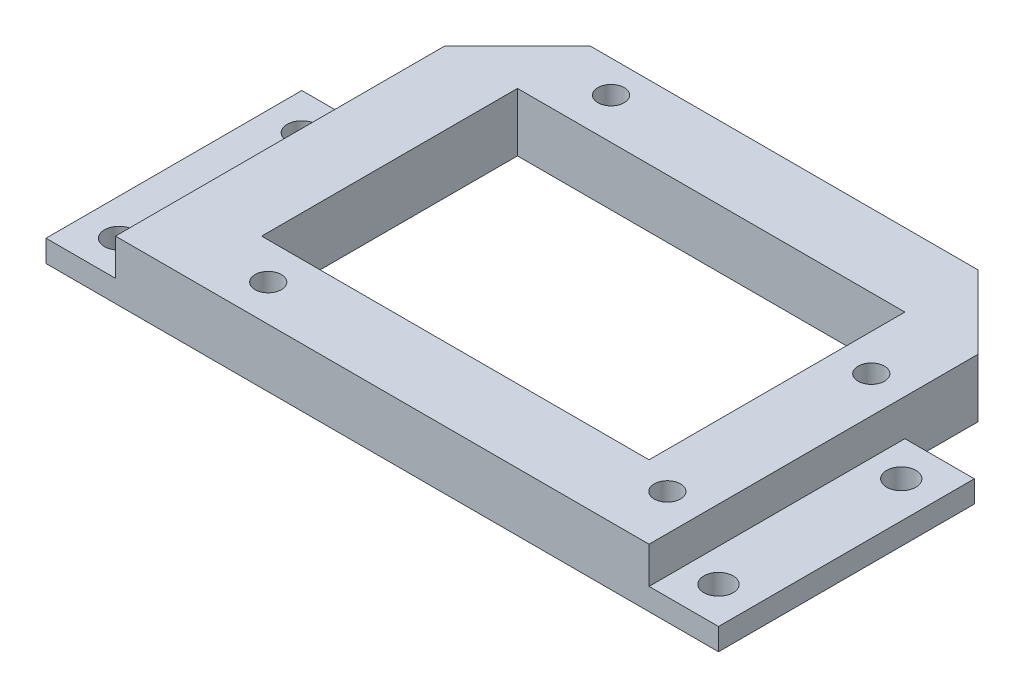
ISO-10303-21;
HEADER;
FILE_DESCRIPTION(('STEP AP214'),'2;1');
FILE_NAME('part.step','',(''),(''),'','','');
FILE_SCHEMA(('AUTOMOTIVE_DESIGN { 1 0 10303 214 1 1 1 1 }'));
ENDSEC;
DATA;
#1=APPLICATION_CONTEXT('core data for automotive mechanical design processes');
#2=APPLICATION_PROTOCOL_DEFINITION('international standard','automotive_design',2000,#1);
#3=PRODUCT_CONTEXT('',#1,'mechanical');
#4=PRODUCT('Part','Part','',(#3));
#5=PRODUCT_RELATED_PRODUCT_CATEGORY('part','',(#4));
#6=PRODUCT_DEFINITION_FORMATION('','',#4);
#7=PRODUCT_DEFINITION_CONTEXT('part definition',#1,'design');
#8=PRODUCT_DEFINITION('design','',#6,#7);
#9=PRODUCT_DEFINITION_SHAPE('','',#8);
#10=(LENGTH_UNIT() NAMED_UNIT(*) SI_UNIT(.MILLI.,.METRE.));
#11=(NAMED_UNIT(*) PLANE_ANGLE_UNIT() SI_UNIT($,.RADIAN.));
#12=(NAMED_UNIT(*) SI_UNIT($,.STERADIAN.) SOLID_ANGLE_UNIT());
#13=UNCERTAINTY_MEASURE_WITH_UNIT(LENGTH_MEASURE(1.E-05),#10,'distance_accuracy_value','');
#14=(GEOMETRIC_REPRESENTATION_CONTEXT(3) GLOBAL_UNCERTAINTY_ASSIGNED_CONTEXT((#13)) GLOBAL_UNIT_ASSIGNED_CONTEXT((#10,
#11,#12)) REPRESENTATION_CONTEXT('',''));
#15=CARTESIAN_POINT('',(0.,0.,0.));
#16=DIRECTION('',(0.,0.,1.));
#17=DIRECTION('',(1.,0.,0.));
#18=AXIS2_PLACEMENT_3D('',#15,#16,#17);
#19=CARTESIAN_POINT('',(-36.5,5.,-17.5));
#20=DIRECTION('',(0.,0.,1.));
#21=DIRECTION('',(1.,0.,0.));
#22=AXIS2_PLACEMENT_3D('',#19,#20,#21);
#23=PLANE('',#22);
#24=DIRECTION('',(0.,-1.,0.));
#25=VECTOR('',#24,1.);
#26=CARTESIAN_POINT('',(36.5,5.,-17.5));
#27=LINE('',#26,#25);
#28=CARTESIAN_POINT('',(36.5,0.,-17.5));
#29=VERTEX_POINT('',#28);
#30=CARTESIAN_POINT('',(36.5,-3.,-17.5));
#31=VERTEX_POINT('',#30);
#32=EDGE_CURVE('E241',#29,#31,#27,.T.);
#33=ORIENTED_EDGE('',*,*,#32,.F.);
#34=DIRECTION('',(1.,0.,0.));
#35=VECTOR('',#34,1.);
#36=CARTESIAN_POINT('',(-46.,0.,-17.5));
#37=LINE('',#36,#35);
#38=CARTESIAN_POINT('',(46.,0.,-17.5));
#39=VERTEX_POINT('',#38);
#40=EDGE_CURVE('E303',#29,#39,#37,.T.);
#41=ORIENTED_EDGE('',*,*,#40,.T.);
#42=DIRECTION('',(0.,1.,0.));
#43=VECTOR('',#42,1.);
#44=CARTESIAN_POINT('',(46.,-3.,-17.5));
#45=LINE('',#44,#43);
#46=CARTESIAN_POINT('',(46.,-3.,-17.5));
#47=VERTEX_POINT('',#46);
#48=EDGE_CURVE('E290',#47,#39,#45,.T.);
#49=ORIENTED_EDGE('',*,*,#48,.F.);
#50=DIRECTION('',(1.,0.,0.));
#51=VECTOR('',#50,1.);
#52=CARTESIAN_POINT('',(-46.,-3.,-17.5));
#53=LINE('',#52,#51);
#54=EDGE_CURVE('E285',#31,#47,#53,.T.);
#55=ORIENTED_EDGE('',*,*,#54,.F.);
#56=EDGE_LOOP('',(#33,#41,#49,#55));
#57=FACE_BOUND('',#56,.T.);
#58=ADVANCED_FACE('F41',(#57),#23,.F.);
#59=DIRECTION('',(0.,1.,0.));
#60=VECTOR('',#59,1.);
#61=CARTESIAN_POINT('',(-36.5,5.,-17.5));
#62=LINE('',#61,#60);
#63=CARTESIAN_POINT('',(-36.5,-3.,-17.5));
#64=VERTEX_POINT('',#63);
#65=CARTESIAN_POINT('',(-36.5,0.,-17.5));
#66=VERTEX_POINT('',#65);
#67=EDGE_CURVE('E236',#64,#66,#62,.T.);
#68=ORIENTED_EDGE('',*,*,#67,.F.);
#69=CARTESIAN_POINT('',(-46.,-3.,-17.5));
#70=VERTEX_POINT('',#69);
#71=EDGE_CURVE('E286',#70,#64,#53,.T.);
#72=ORIENTED_EDGE('',*,*,#71,.F.);
#73=DIRECTION('',(0.,1.,0.));
#74=VECTOR('',#73,1.);
#75=CARTESIAN_POINT('',(-46.,-3.,-17.5));
#76=LINE('',#75,#74);
#77=CARTESIAN_POINT('',(-46.,0.,-17.5));
#78=VERTEX_POINT('',#77);
#79=EDGE_CURVE('E310',#70,#78,#76,.T.);
#80=ORIENTED_EDGE('',*,*,#79,.T.);
#81=EDGE_CURVE('E279',#78,#66,#37,.T.);
#82=ORIENTED_EDGE('',*,*,#81,.T.);
#83=EDGE_LOOP('',(#68,#72,#80,#82));
#84=FACE_BOUND('',#83,.T.);
#85=ADVANCED_FACE('F431',(#84),#23,.F.);
#86=CARTESIAN_POINT('',(36.5,5.,17.5));
#87=DIRECTION('',(-1.,0.,0.));
#88=DIRECTION('',(0.,0.,1.));
#89=AXIS2_PLACEMENT_3D('',#86,#87,#88);
#90=PLANE('',#89);
#91=DIRECTION('',(0.,0.,1.));
#92=VECTOR('',#91,1.);
#93=CARTESIAN_POINT('',(36.5,-3.,-37.5));
#94=LINE('',#93,#92);
#95=CARTESIAN_POINT('',(36.5,-3.,-27.5));
#96=VERTEX_POINT('',#95);
#97=EDGE_CURVE('E251',#96,#31,#94,.T.);
#98=ORIENTED_EDGE('',*,*,#97,.F.);
#99=DIRECTION('',(0.,1.,0.));
#100=VECTOR('',#99,1.);
#101=CARTESIAN_POINT('',(36.5,5.,-27.5));
#102=LINE('',#101,#100);
#103=CARTESIAN_POINT('',(36.5,5.,-27.5));
#104=VERTEX_POINT('',#103);
#105=EDGE_CURVE('E11',#96,#104,#102,.T.);
#106=ORIENTED_EDGE('',*,*,#105,.T.);
#107=DIRECTION('',(0.,0.,-1.));
#108=VECTOR('',#107,1.);
#109=CARTESIAN_POINT('',(36.5,5.,17.5));
#110=LINE('',#109,#108);
#111=CARTESIAN_POINT('',(36.5,5.,17.5));
#112=VERTEX_POINT('',#111);
#113=EDGE_CURVE('E323',#112,#104,#110,.T.);
#114=ORIENTED_EDGE('',*,*,#113,.F.);
#115=DIRECTION('',(0.,-1.,0.));
#116=VECTOR('',#115,1.);
#117=CARTESIAN_POINT('',(36.5,5.,17.5));
#118=LINE('',#117,#116);
#119=CARTESIAN_POINT('',(36.5,0.,17.5));
#120=VERTEX_POINT('',#119);
#121=EDGE_CURVE('E334',#112,#120,#118,.T.);
#122=ORIENTED_EDGE('',*,*,#121,.T.);
#123=DIRECTION('',(0.,0.,-1.));
#124=VECTOR('',#123,1.);
#125=CARTESIAN_POINT('',(36.5,0.,17.5));
#126=LINE('',#125,#124);
#127=EDGE_CURVE('E322',#120,#29,#126,.T.);
#128=ORIENTED_EDGE('',*,*,#127,.T.);
#129=ORIENTED_EDGE('',*,*,#32,.T.);
#130=EDGE_LOOP('',(#98,#106,#114,#122,#128,#129));
#131=FACE_BOUND('',#130,.T.);
#132=ADVANCED_FACE('F410',(#131),#90,.F.);
#133=CARTESIAN_POINT('',(-36.5,5.,17.5));
#134=DIRECTION('',(1.,0.,0.));
#135=DIRECTION('',(0.,0.,-1.));
#136=AXIS2_PLACEMENT_3D('',#133,#134,#135);
#137=PLANE('',#136);
#138=DIRECTION('',(0.,0.,1.));
#139=VECTOR('',#138,1.);
#140=CARTESIAN_POINT('',(-36.5,5.,17.5));
#141=LINE('',#140,#139);
#142=CARTESIAN_POINT('',(-36.5,5.,-27.5));
#143=VERTEX_POINT('',#142);
#144=CARTESIAN_POINT('',(-36.5,5.,17.5));
#145=VERTEX_POINT('',#144);
#146=EDGE_CURVE('E327',#143,#145,#141,.T.);
#147=ORIENTED_EDGE('',*,*,#146,.F.);
#148=DIRECTION('',(0.,-1.,0.));
#149=VECTOR('',#148,1.);
#150=CARTESIAN_POINT('',(-36.5,-3.,-27.5));
#151=LINE('',#150,#149);
#152=CARTESIAN_POINT('',(-36.5,-3.,-27.5));
#153=VERTEX_POINT('',#152);
#154=EDGE_CURVE('E66',#143,#153,#151,.T.);
#155=ORIENTED_EDGE('',*,*,#154,.T.);
#156=DIRECTION('',(0.,0.,1.));
#157=VECTOR('',#156,1.);
#158=CARTESIAN_POINT('',(-36.5,-3.,-37.5));
#159=LINE('',#158,#157);
#160=EDGE_CURVE('E240',#153,#64,#159,.T.);
#161=ORIENTED_EDGE('',*,*,#160,.T.);
#162=ORIENTED_EDGE('',*,*,#67,.T.);
#163=DIRECTION('',(0.,0.,1.));
#164=VECTOR('',#163,1.);
#165=CARTESIAN_POINT('',(-36.5,0.,17.5));
#166=LINE('',#165,#164);
#167=CARTESIAN_POINT('',(-36.5,0.,17.5));
#168=VERTEX_POINT('',#167);
#169=EDGE_CURVE('E328',#66,#168,#166,.T.);
#170=ORIENTED_EDGE('',*,*,#169,.T.);
#171=DIRECTION('',(0.,-1.,0.));
#172=VECTOR('',#171,1.);
#173=CARTESIAN_POINT('',(-36.5,5.,17.5));
#174=LINE('',#173,#172);
#175=EDGE_CURVE('E246',#145,#168,#174,.T.);
#176=ORIENTED_EDGE('',*,*,#175,.F.);
#177=EDGE_LOOP('',(#147,#155,#161,#162,#170,#176));
#178=FACE_BOUND('',#177,.T.);
#179=ADVANCED_FACE('F399',(#178),#137,.F.);
#180=CARTESIAN_POINT('',(-36.5,5.,17.5));
#181=DIRECTION('',(0.,0.,-1.));
#182=DIRECTION('',(-1.,0.,0.));
#183=AXIS2_PLACEMENT_3D('',#180,#181,#182);
#184=PLANE('',#183);
#185=ORIENTED_EDGE('',*,*,#175,.T.);
#186=DIRECTION('',(-1.,0.,0.));
#187=VECTOR('',#186,1.);
#188=CARTESIAN_POINT('',(-46.,0.,17.5));
#189=LINE('',#188,#187);
#190=CARTESIAN_POINT('',(-46.,0.,17.5));
#191=VERTEX_POINT('',#190);
#192=EDGE_CURVE('E295',#168,#191,#189,.T.);
#193=ORIENTED_EDGE('',*,*,#192,.T.);
#194=DIRECTION('',(0.,1.,0.));
#195=VECTOR('',#194,1.);
#196=CARTESIAN_POINT('',(-46.,-3.,17.5));
#197=LINE('',#196,#195);
#198=CARTESIAN_POINT('',(-46.,-3.,17.5));
#199=VERTEX_POINT('',#198);
#200=EDGE_CURVE('E314',#199,#191,#197,.T.);
#201=ORIENTED_EDGE('',*,*,#200,.F.);
#202=DIRECTION('',(-1.,0.,0.));
#203=VECTOR('',#202,1.);
#204=CARTESIAN_POINT('',(-46.,-3.,17.5));
#205=LINE('',#204,#203);
#206=CARTESIAN_POINT('',(46.,-3.,17.5));
#207=VERTEX_POINT('',#206);
#208=EDGE_CURVE('E278',#207,#199,#205,.T.);
#209=ORIENTED_EDGE('',*,*,#208,.F.);
#210=DIRECTION('',(0.,1.,0.));
#211=VECTOR('',#210,1.);
#212=CARTESIAN_POINT('',(46.,-3.,17.5));
#213=LINE('',#212,#211);
#214=CARTESIAN_POINT('',(46.,0.,17.5));
#215=VERTEX_POINT('',#214);
#216=EDGE_CURVE('E318',#207,#215,#213,.T.);
#217=ORIENTED_EDGE('',*,*,#216,.T.);
#218=EDGE_CURVE('E296',#215,#120,#189,.T.);
#219=ORIENTED_EDGE('',*,*,#218,.T.);
#220=ORIENTED_EDGE('',*,*,#121,.F.);
#221=DIRECTION('',(1.,0.,0.));
#222=VECTOR('',#221,1.);
#223=CARTESIAN_POINT('',(-36.5,5.,17.5));
#224=LINE('',#223,#222);
#225=EDGE_CURVE('E331',#145,#112,#224,.T.);
#226=ORIENTED_EDGE('',*,*,#225,.F.);
#227=EDGE_LOOP('',(#185,#193,#201,#209,#217,#219,#220,#226));
#228=FACE_BOUND('',#227,.T.);
#229=ADVANCED_FACE('F404',(#228),#184,.F.);
#230=CARTESIAN_POINT('',(0.,5.,0.));
#231=DIRECTION('',(0.,-1.,0.));
#232=DIRECTION('',(0.,0.,-1.));
#233=AXIS2_PLACEMENT_3D('',#230,#231,#232);
#234=PLANE('',#233);
#235=DIRECTION('',(0.,0.,-1.));
#236=VECTOR('',#235,1.);
#237=CARTESIAN_POINT('',(26.5,5.,7.5));
#238=LINE('',#237,#236);
#239=CARTESIAN_POINT('',(26.5,5.,7.5));
#240=VERTEX_POINT('',#239);
#241=CARTESIAN_POINT('',(26.5,5.,-27.5));
#242=VERTEX_POINT('',#241);
#243=EDGE_CURVE('E197',#240,#242,#238,.T.);
#244=ORIENTED_EDGE('',*,*,#243,.F.);
#245=DIRECTION('',(1.,0.,0.));
#246=VECTOR('',#245,1.);
#247=CARTESIAN_POINT('',(-26.5,5.,7.5));
#248=LINE('',#247,#246);
#249=CARTESIAN_POINT('',(-26.5,5.,7.5));
#250=VERTEX_POINT('',#249);
#251=EDGE_CURVE('E163',#250,#240,#248,.T.);
#252=ORIENTED_EDGE('',*,*,#251,.F.);
#253=DIRECTION('',(0.,0.,1.));
#254=VECTOR('',#253,1.);
#255=CARTESIAN_POINT('',(-26.5,5.,-27.5));
#256=LINE('',#255,#254);
#257=CARTESIAN_POINT('',(-26.5,5.,-27.5));
#258=VERTEX_POINT('',#257);
#259=EDGE_CURVE('E184',#258,#250,#256,.T.);
#260=ORIENTED_EDGE('',*,*,#259,.F.);
#261=DIRECTION('',(-1.,0.,0.));
#262=VECTOR('',#261,1.);
#263=CARTESIAN_POINT('',(26.5,5.,-27.5));
#264=LINE('',#263,#262);
#265=EDGE_CURVE('E188',#242,#258,#264,.T.);
#266=ORIENTED_EDGE('',*,*,#265,.F.);
#267=EDGE_LOOP('',(#244,#252,#260,#266));
#268=FACE_BOUND('',#267,.T.);
#269=CARTESIAN_POINT('',(-20.6,5.,12.5));
#270=DIRECTION('',(0.,1.,0.));
#271=DIRECTION('',(0.,0.,1.));
#272=AXIS2_PLACEMENT_3D('',#269,#270,#271);
#273=CIRCLE('',#272,1.8);
#274=CARTESIAN_POINT('',(-20.6,5.,14.3));
#275=VERTEX_POINT('',#274);
#276=EDGE_CURVE('E206',#275,#275,#273,.T.);
#277=ORIENTED_EDGE('',*,*,#276,.F.);
#278=EDGE_LOOP('',(#277));
#279=FACE_BOUND('',#278,.T.);
#280=CARTESIAN_POINT('',(-19.3,5.,-33.1));
#281=DIRECTION('',(0.,1.,0.));
#282=DIRECTION('',(0.,0.,1.));
#283=AXIS2_PLACEMENT_3D('',#280,#281,#282);
#284=CIRCLE('',#283,1.8);
#285=CARTESIAN_POINT('',(-19.3,5.,-31.3));
#286=VERTEX_POINT('',#285);
#287=EDGE_CURVE('E216',#286,#286,#284,.T.);
#288=ORIENTED_EDGE('',*,*,#287,.F.);
#289=EDGE_LOOP('',(#288));
#290=FACE_BOUND('',#289,.T.);
#291=CARTESIAN_POINT('',(31.5,5.,10.));
#292=DIRECTION('',(0.,1.,0.));
#293=DIRECTION('',(0.,0.,1.));
#294=AXIS2_PLACEMENT_3D('',#291,#292,#293);
#295=CIRCLE('',#294,1.8);
#296=CARTESIAN_POINT('',(31.5,5.,11.8));
#297=VERTEX_POINT('',#296);
#298=EDGE_CURVE('E221',#297,#297,#295,.T.);
#299=ORIENTED_EDGE('',*,*,#298,.F.);
#300=EDGE_LOOP('',(#299));
#301=FACE_BOUND('',#300,.T.);
#302=CARTESIAN_POINT('',(31.5,5.,-17.9));
#303=DIRECTION('',(0.,1.,0.));
#304=DIRECTION('',(0.,0.,1.));
#305=AXIS2_PLACEMENT_3D('',#302,#303,#304);
#306=CIRCLE('',#305,1.8);
#307=CARTESIAN_POINT('',(31.5,5.,-16.1));
#308=VERTEX_POINT('',#307);
#309=EDGE_CURVE('E226',#308,#308,#306,.T.);
#310=ORIENTED_EDGE('',*,*,#309,.F.);
#311=EDGE_LOOP('',(#310));
#312=FACE_BOUND('',#311,.T.);
#313=DIRECTION('',(1.,0.,0.));
#314=VECTOR('',#313,1.);
#315=CARTESIAN_POINT('',(36.5,5.,-37.5));
#316=LINE('',#315,#314);
#317=CARTESIAN_POINT('',(-26.5,5.,-37.5));
#318=VERTEX_POINT('',#317);
#319=CARTESIAN_POINT('',(26.5,5.,-37.5));
#320=VERTEX_POINT('',#319);
#321=EDGE_CURVE('E235',#318,#320,#316,.T.);
#322=ORIENTED_EDGE('',*,*,#321,.F.);
#323=DIRECTION('',(-0.707106781186547,0.,0.707106781186548));
#324=VECTOR('',#323,1.);
#325=CARTESIAN_POINT('',(-26.5,5.,-37.5));
#326=LINE('',#325,#324);
#327=EDGE_CURVE('E381',#318,#143,#326,.T.);
#328=ORIENTED_EDGE('',*,*,#327,.T.);
#329=ORIENTED_EDGE('',*,*,#146,.T.);
#330=ORIENTED_EDGE('',*,*,#225,.T.);
#331=ORIENTED_EDGE('',*,*,#113,.T.);
#332=DIRECTION('',(-0.707106781186547,0.,-0.707106781186548));
#333=VECTOR('',#332,1.);
#334=CARTESIAN_POINT('',(26.5,5.,-37.5));
#335=LINE('',#334,#333);
#336=EDGE_CURVE('E378',#104,#320,#335,.T.);
#337=ORIENTED_EDGE('',*,*,#336,.T.);
#338=EDGE_LOOP('',(#322,#328,#329,#330,#331,#337));
#339=FACE_BOUND('',#338,.T.);
#340=ADVANCED_FACE('F397',(#268,#279,#290,#301,#312,#339),#234,.F.);
#341=CARTESIAN_POINT('',(0.,0.,0.));
#342=DIRECTION('',(0.,1.,0.));
#343=DIRECTION('',(0.,0.,1.));
#344=AXIS2_PLACEMENT_3D('',#341,#342,#343);
#345=PLANE('',#344);
#346=CARTESIAN_POINT('',(41.,0.,-12.5));
#347=DIRECTION('',(0.,1.,0.));
#348=DIRECTION('',(0.,0.,1.));
#349=AXIS2_PLACEMENT_3D('',#346,#347,#348);
#350=CIRCLE('',#349,2.);
#351=CARTESIAN_POINT('',(41.,0.,-10.5));
#352=VERTEX_POINT('',#351);
#353=EDGE_CURVE('E264',#352,#352,#350,.T.);
#354=ORIENTED_EDGE('',*,*,#353,.F.);
#355=EDGE_LOOP('',(#354));
#356=FACE_BOUND('',#355,.T.);
#357=CARTESIAN_POINT('',(41.,0.,12.5));
#358=DIRECTION('',(0.,1.,0.));
#359=DIRECTION('',(0.,0.,1.));
#360=AXIS2_PLACEMENT_3D('',#357,#358,#359);
#361=CIRCLE('',#360,2.);
#362=CARTESIAN_POINT('',(41.,0.,14.5));
#363=VERTEX_POINT('',#362);
#364=EDGE_CURVE('E269',#363,#363,#361,.T.);
#365=ORIENTED_EDGE('',*,*,#364,.F.);
#366=EDGE_LOOP('',(#365));
#367=FACE_BOUND('',#366,.T.);
#368=ORIENTED_EDGE('',*,*,#127,.F.);
#369=ORIENTED_EDGE('',*,*,#218,.F.);
#370=DIRECTION('',(0.,0.,1.));
#371=VECTOR('',#370,1.);
#372=CARTESIAN_POINT('',(46.,0.,-17.5));
#373=LINE('',#372,#371);
#374=EDGE_CURVE('E291',#39,#215,#373,.T.);
#375=ORIENTED_EDGE('',*,*,#374,.F.);
#376=ORIENTED_EDGE('',*,*,#40,.F.);
#377=EDGE_LOOP('',(#368,#369,#375,#376));
#378=FACE_BOUND('',#377,.T.);
#379=ADVANCED_FACE('F437',(#356,#367,#378),#345,.T.);
#380=CARTESIAN_POINT('',(-41.,0.,-12.5));
#381=DIRECTION('',(0.,1.,0.));
#382=DIRECTION('',(0.,0.,1.));
#383=AXIS2_PLACEMENT_3D('',#380,#381,#382);
#384=CIRCLE('',#383,2.);
#385=CARTESIAN_POINT('',(-41.,0.,-10.5));
#386=VERTEX_POINT('',#385);
#387=EDGE_CURVE('E254',#386,#386,#384,.T.);
#388=ORIENTED_EDGE('',*,*,#387,.F.);
#389=EDGE_LOOP('',(#388));
#390=FACE_BOUND('',#389,.T.);
#391=CARTESIAN_POINT('',(-41.,0.,12.5));
#392=DIRECTION('',(0.,1.,0.));
#393=DIRECTION('',(0.,0.,1.));
#394=AXIS2_PLACEMENT_3D('',#391,#392,#393);
#395=CIRCLE('',#394,2.);
#396=CARTESIAN_POINT('',(-41.,0.,14.5));
#397=VERTEX_POINT('',#396);
#398=EDGE_CURVE('E259',#397,#397,#395,.T.);
#399=ORIENTED_EDGE('',*,*,#398,.F.);
#400=EDGE_LOOP('',(#399));
#401=FACE_BOUND('',#400,.T.);
#402=ORIENTED_EDGE('',*,*,#169,.F.);
#403=ORIENTED_EDGE('',*,*,#81,.F.);
#404=DIRECTION('',(0.,0.,-1.));
#405=VECTOR('',#404,1.);
#406=CARTESIAN_POINT('',(-46.,0.,-17.5));
#407=LINE('',#406,#405);
#408=EDGE_CURVE('E300',#191,#78,#407,.T.);
#409=ORIENTED_EDGE('',*,*,#408,.F.);
#410=ORIENTED_EDGE('',*,*,#192,.F.);
#411=EDGE_LOOP('',(#402,#403,#409,#410));
#412=FACE_BOUND('',#411,.T.);
#413=ADVANCED_FACE('F433',(#390,#401,#412),#345,.T.);
#414=CARTESIAN_POINT('',(46.,-3.,-17.5));
#415=DIRECTION('',(-1.,0.,0.));
#416=DIRECTION('',(0.,0.,1.));
#417=AXIS2_PLACEMENT_3D('',#414,#415,#416);
#418=PLANE('',#417);
#419=ORIENTED_EDGE('',*,*,#374,.T.);
#420=ORIENTED_EDGE('',*,*,#216,.F.);
#421=DIRECTION('',(0.,0.,1.));
#422=VECTOR('',#421,1.);
#423=CARTESIAN_POINT('',(46.,-3.,-17.5));
#424=LINE('',#423,#422);
#425=EDGE_CURVE('E274',#47,#207,#424,.T.);
#426=ORIENTED_EDGE('',*,*,#425,.F.);
#427=ORIENTED_EDGE('',*,*,#48,.T.);
#428=EDGE_LOOP('',(#419,#420,#426,#427));
#429=FACE_BOUND('',#428,.T.);
#430=ADVANCED_FACE('F420',(#429),#418,.F.);
#431=CARTESIAN_POINT('',(-46.,-3.,-17.5));
#432=DIRECTION('',(1.,0.,0.));
#433=DIRECTION('',(0.,0.,-1.));
#434=AXIS2_PLACEMENT_3D('',#431,#432,#433);
#435=PLANE('',#434);
#436=ORIENTED_EDGE('',*,*,#408,.T.);
#437=ORIENTED_EDGE('',*,*,#79,.F.);
#438=DIRECTION('',(0.,0.,-1.));
#439=VECTOR('',#438,1.);
#440=CARTESIAN_POINT('',(-46.,-3.,-17.5));
#441=LINE('',#440,#439);
#442=EDGE_CURVE('E282',#199,#70,#441,.T.);
#443=ORIENTED_EDGE('',*,*,#442,.F.);
#444=ORIENTED_EDGE('',*,*,#200,.T.);
#445=EDGE_LOOP('',(#436,#437,#443,#444));
#446=FACE_BOUND('',#445,.T.);
#447=ADVANCED_FACE('F426',(#446),#435,.F.);
#448=CARTESIAN_POINT('',(0.,-3.,0.));
#449=DIRECTION('',(0.,1.,0.));
#450=DIRECTION('',(0.,0.,1.));
#451=AXIS2_PLACEMENT_3D('',#448,#449,#450);
#452=PLANE('',#451);
#453=DIRECTION('',(0.,0.,1.));
#454=VECTOR('',#453,1.);
#455=CARTESIAN_POINT('',(-26.5,-3.,-27.5));
#456=LINE('',#455,#454);
#457=CARTESIAN_POINT('',(-26.5,-3.,-27.5));
#458=VERTEX_POINT('',#457);
#459=CARTESIAN_POINT('',(-26.5,-3.,7.5));
#460=VERTEX_POINT('',#459);
#461=EDGE_CURVE('E169',#458,#460,#456,.T.);
#462=ORIENTED_EDGE('',*,*,#461,.T.);
#463=DIRECTION('',(1.,0.,0.));
#464=VECTOR('',#463,1.);
#465=CARTESIAN_POINT('',(-26.5,-3.,7.5));
#466=LINE('',#465,#464);
#467=CARTESIAN_POINT('',(26.5,-3.,7.5));
#468=VERTEX_POINT('',#467);
#469=EDGE_CURVE('E160',#460,#468,#466,.T.);
#470=ORIENTED_EDGE('',*,*,#469,.T.);
#471=DIRECTION('',(0.,0.,-1.));
#472=VECTOR('',#471,1.);
#473=CARTESIAN_POINT('',(26.5,-3.,7.5));
#474=LINE('',#473,#472);
#475=CARTESIAN_POINT('',(26.5,-3.,-27.5));
#476=VERTEX_POINT('',#475);
#477=EDGE_CURVE('E173',#468,#476,#474,.T.);
#478=ORIENTED_EDGE('',*,*,#477,.T.);
#479=DIRECTION('',(-1.,0.,0.));
#480=VECTOR('',#479,1.);
#481=CARTESIAN_POINT('',(26.5,-3.,-27.5));
#482=LINE('',#481,#480);
#483=EDGE_CURVE('E178',#476,#458,#482,.T.);
#484=ORIENTED_EDGE('',*,*,#483,.T.);
#485=EDGE_LOOP('',(#462,#470,#478,#484));
#486=FACE_BOUND('',#485,.T.);
#487=CARTESIAN_POINT('',(-20.6,-3.,12.5));
#488=DIRECTION('',(0.,1.,0.));
#489=DIRECTION('',(0.,0.,1.));
#490=AXIS2_PLACEMENT_3D('',#487,#488,#489);
#491=CIRCLE('',#490,1.8);
#492=CARTESIAN_POINT('',(-20.6,-3.,14.3));
#493=VERTEX_POINT('',#492);
#494=EDGE_CURVE('E215',#493,#493,#491,.T.);
#495=ORIENTED_EDGE('',*,*,#494,.T.);
#496=EDGE_LOOP('',(#495));
#497=FACE_BOUND('',#496,.T.);
#498=CARTESIAN_POINT('',(-19.3,-3.,-33.1));
#499=DIRECTION('',(0.,1.,0.));
#500=DIRECTION('',(0.,0.,1.));
#501=AXIS2_PLACEMENT_3D('',#498,#499,#500);
#502=CIRCLE('',#501,1.8);
#503=CARTESIAN_POINT('',(-19.3,-3.,-31.3));
#504=VERTEX_POINT('',#503);
#505=EDGE_CURVE('E220',#504,#504,#502,.T.);
#506=ORIENTED_EDGE('',*,*,#505,.T.);
#507=EDGE_LOOP('',(#506));
#508=FACE_BOUND('',#507,.T.);
#509=CARTESIAN_POINT('',(31.5,-3.,10.));
#510=DIRECTION('',(0.,1.,0.));
#511=DIRECTION('',(0.,0.,1.));
#512=AXIS2_PLACEMENT_3D('',#509,#510,#511);
#513=CIRCLE('',#512,1.8);
#514=CARTESIAN_POINT('',(31.5,-3.,11.8));
#515=VERTEX_POINT('',#514);
#516=EDGE_CURVE('E225',#515,#515,#513,.T.);
#517=ORIENTED_EDGE('',*,*,#516,.T.);
#518=EDGE_LOOP('',(#517));
#519=FACE_BOUND('',#518,.T.);
#520=CARTESIAN_POINT('',(31.5,-3.,-17.9));
#521=DIRECTION('',(0.,1.,0.));
#522=DIRECTION('',(0.,0.,1.));
#523=AXIS2_PLACEMENT_3D('',#520,#521,#522);
#524=CIRCLE('',#523,1.8);
#525=CARTESIAN_POINT('',(31.5,-3.,-16.1));
#526=VERTEX_POINT('',#525);
#527=EDGE_CURVE('E230',#526,#526,#524,.T.);
#528=ORIENTED_EDGE('',*,*,#527,.T.);
#529=EDGE_LOOP('',(#528));
#530=FACE_BOUND('',#529,.T.);
#531=CARTESIAN_POINT('',(-41.,-3.,-12.5));
#532=DIRECTION('',(0.,1.,0.));
#533=DIRECTION('',(0.,0.,1.));
#534=AXIS2_PLACEMENT_3D('',#531,#532,#533);
#535=CIRCLE('',#534,2.);
#536=CARTESIAN_POINT('',(-41.,-3.,-10.5));
#537=VERTEX_POINT('',#536);
#538=EDGE_CURVE('E258',#537,#537,#535,.T.);
#539=ORIENTED_EDGE('',*,*,#538,.T.);
#540=EDGE_LOOP('',(#539));
#541=FACE_BOUND('',#540,.T.);
#542=CARTESIAN_POINT('',(-41.,-3.,12.5));
#543=DIRECTION('',(0.,1.,0.));
#544=DIRECTION('',(0.,0.,1.));
#545=AXIS2_PLACEMENT_3D('',#542,#543,#544);
#546=CIRCLE('',#545,2.);
#547=CARTESIAN_POINT('',(-41.,-3.,14.5));
#548=VERTEX_POINT('',#547);
#549=EDGE_CURVE('E263',#548,#548,#546,.T.);
#550=ORIENTED_EDGE('',*,*,#549,.T.);
#551=EDGE_LOOP('',(#550));
#552=FACE_BOUND('',#551,.T.);
#553=CARTESIAN_POINT('',(41.,-3.,-12.5));
#554=DIRECTION('',(0.,1.,0.));
#555=DIRECTION('',(0.,0.,1.));
#556=AXIS2_PLACEMENT_3D('',#553,#554,#555);
#557=CIRCLE('',#556,2.);
#558=CARTESIAN_POINT('',(41.,-3.,-10.5));
#559=VERTEX_POINT('',#558);
#560=EDGE_CURVE('E268',#559,#559,#557,.T.);
#561=ORIENTED_EDGE('',*,*,#560,.T.);
#562=EDGE_LOOP('',(#561));
#563=FACE_BOUND('',#562,.T.);
#564=CARTESIAN_POINT('',(41.,-3.,12.5));
#565=DIRECTION('',(0.,1.,0.));
#566=DIRECTION('',(0.,0.,1.));
#567=AXIS2_PLACEMENT_3D('',#564,#565,#566);
#568=CIRCLE('',#567,2.);
#569=CARTESIAN_POINT('',(41.,-3.,14.5));
#570=VERTEX_POINT('',#569);
#571=EDGE_CURVE('E273',#570,#570,#568,.T.);
#572=ORIENTED_EDGE('',*,*,#571,.T.);
#573=EDGE_LOOP('',(#572));
#574=FACE_BOUND('',#573,.T.);
#575=ORIENTED_EDGE('',*,*,#160,.F.);
#576=DIRECTION('',(0.707106781186547,0.,-0.707106781186548));
#577=VECTOR('',#576,1.);
#578=CARTESIAN_POINT('',(-26.5,-3.,-37.5));
#579=LINE('',#578,#577);
#580=CARTESIAN_POINT('',(-26.5,-3.,-37.5));
#581=VERTEX_POINT('',#580);
#582=EDGE_CURVE('E51',#153,#581,#579,.T.);
#583=ORIENTED_EDGE('',*,*,#582,.T.);
#584=DIRECTION('',(-1.,0.,0.));
#585=VECTOR('',#584,1.);
#586=CARTESIAN_POINT('',(36.5,-3.,-37.5));
#587=LINE('',#586,#585);
#588=CARTESIAN_POINT('',(26.5,-3.,-37.5));
#589=VERTEX_POINT('',#588);
#590=EDGE_CURVE('E231',#589,#581,#587,.T.);
#591=ORIENTED_EDGE('',*,*,#590,.F.);
#592=DIRECTION('',(0.707106781186547,0.,0.707106781186548));
#593=VECTOR('',#592,1.);
#594=CARTESIAN_POINT('',(26.5,-3.,-37.5));
#595=LINE('',#594,#593);
#596=EDGE_CURVE('E58',#589,#96,#595,.T.);
#597=ORIENTED_EDGE('',*,*,#596,.T.);
#598=ORIENTED_EDGE('',*,*,#97,.T.);
#599=ORIENTED_EDGE('',*,*,#54,.T.);
#600=ORIENTED_EDGE('',*,*,#425,.T.);
#601=ORIENTED_EDGE('',*,*,#208,.T.);
#602=ORIENTED_EDGE('',*,*,#442,.T.);
#603=ORIENTED_EDGE('',*,*,#71,.T.);
#604=EDGE_LOOP('',(#575,#583,#591,#597,#598,#599,#600,#601,#602,#603));
#605=FACE_BOUND('',#604,.T.);
#606=ADVANCED_FACE('F180',(#486,#497,#508,#519,#530,#541,#552,#563,#574,#605),#452,.F.);
#607=CARTESIAN_POINT('',(41.,0.,12.5));
#608=DIRECTION('',(0.,1.,0.));
#609=DIRECTION('',(0.,0.,1.));
#610=AXIS2_PLACEMENT_3D('',#607,#608,#609);
#611=CYLINDRICAL_SURFACE('',#610,2.);
#612=ORIENTED_EDGE('',*,*,#364,.T.);
#613=EDGE_LOOP('',(#612));
#614=FACE_BOUND('',#613,.T.);
#615=ORIENTED_EDGE('',*,*,#571,.F.);
#616=EDGE_LOOP('',(#615));
#617=FACE_BOUND('',#616,.T.);
#618=ADVANCED_FACE('F508',(#614,#617),#611,.F.);
#619=CARTESIAN_POINT('',(41.,0.,-12.5));
#620=DIRECTION('',(0.,1.,0.));
#621=DIRECTION('',(0.,0.,1.));
#622=AXIS2_PLACEMENT_3D('',#619,#620,#621);
#623=CYLINDRICAL_SURFACE('',#622,2.);
#624=ORIENTED_EDGE('',*,*,#353,.T.);
#625=EDGE_LOOP('',(#624));
#626=FACE_BOUND('',#625,.T.);
#627=ORIENTED_EDGE('',*,*,#560,.F.);
#628=EDGE_LOOP('',(#627));
#629=FACE_BOUND('',#628,.T.);
#630=ADVANCED_FACE('F504',(#626,#629),#623,.F.);
#631=CARTESIAN_POINT('',(-41.,0.,12.5));
#632=DIRECTION('',(0.,1.,0.));
#633=DIRECTION('',(0.,0.,1.));
#634=AXIS2_PLACEMENT_3D('',#631,#632,#633);
#635=CYLINDRICAL_SURFACE('',#634,2.);
#636=ORIENTED_EDGE('',*,*,#398,.T.);
#637=EDGE_LOOP('',(#636));
#638=FACE_BOUND('',#637,.T.);
#639=ORIENTED_EDGE('',*,*,#549,.F.);
#640=EDGE_LOOP('',(#639));
#641=FACE_BOUND('',#640,.T.);
#642=ADVANCED_FACE('F500',(#638,#641),#635,.F.);
#643=CARTESIAN_POINT('',(-41.,0.,-12.5));
#644=DIRECTION('',(0.,1.,0.));
#645=DIRECTION('',(0.,0.,1.));
#646=AXIS2_PLACEMENT_3D('',#643,#644,#645);
#647=CYLINDRICAL_SURFACE('',#646,2.);
#648=ORIENTED_EDGE('',*,*,#387,.T.);
#649=EDGE_LOOP('',(#648));
#650=FACE_BOUND('',#649,.T.);
#651=ORIENTED_EDGE('',*,*,#538,.F.);
#652=EDGE_LOOP('',(#651));
#653=FACE_BOUND('',#652,.T.);
#654=ADVANCED_FACE('F497',(#650,#653),#647,.F.);
#655=CARTESIAN_POINT('',(0.,0.,-37.5));
#656=DIRECTION('',(0.,0.,-1.));
#657=DIRECTION('',(-1.,0.,0.));
#658=AXIS2_PLACEMENT_3D('',#655,#656,#657);
#659=PLANE('',#658);
#660=ORIENTED_EDGE('',*,*,#590,.T.);
#661=DIRECTION('',(0.,1.,0.));
#662=VECTOR('',#661,1.);
#663=CARTESIAN_POINT('',(-26.5,5.,-37.5));
#664=LINE('',#663,#662);
#665=EDGE_CURVE('E374',#581,#318,#664,.T.);
#666=ORIENTED_EDGE('',*,*,#665,.T.);
#667=ORIENTED_EDGE('',*,*,#321,.T.);
#668=DIRECTION('',(0.,-1.,0.));
#669=VECTOR('',#668,1.);
#670=CARTESIAN_POINT('',(26.5,-3.,-37.5));
#671=LINE('',#670,#669);
#672=EDGE_CURVE('E245',#320,#589,#671,.T.);
#673=ORIENTED_EDGE('',*,*,#672,.T.);
#674=EDGE_LOOP('',(#660,#666,#667,#673));
#675=FACE_BOUND('',#674,.T.);
#676=ADVANCED_FACE('F392',(#675),#659,.T.);
#677=CARTESIAN_POINT('',(31.5,5.,-17.9));
#678=DIRECTION('',(0.,1.,0.));
#679=DIRECTION('',(0.,0.,1.));
#680=AXIS2_PLACEMENT_3D('',#677,#678,#679);
#681=CYLINDRICAL_SURFACE('',#680,1.8);
#682=ORIENTED_EDGE('',*,*,#309,.T.);
#683=EDGE_LOOP('',(#682));
#684=FACE_BOUND('',#683,.T.);
#685=ORIENTED_EDGE('',*,*,#527,.F.);
#686=EDGE_LOOP('',(#685));
#687=FACE_BOUND('',#686,.T.);
#688=ADVANCED_FACE('F490',(#684,#687),#681,.F.);
#689=CARTESIAN_POINT('',(31.5,5.,10.));
#690=DIRECTION('',(0.,1.,0.));
#691=DIRECTION('',(0.,0.,1.));
#692=AXIS2_PLACEMENT_3D('',#689,#690,#691);
#693=CYLINDRICAL_SURFACE('',#692,1.8);
#694=ORIENTED_EDGE('',*,*,#298,.T.);
#695=EDGE_LOOP('',(#694));
#696=FACE_BOUND('',#695,.T.);
#697=ORIENTED_EDGE('',*,*,#516,.F.);
#698=EDGE_LOOP('',(#697));
#699=FACE_BOUND('',#698,.T.);
#700=ADVANCED_FACE('F486',(#696,#699),#693,.F.);
#701=CARTESIAN_POINT('',(-19.3,5.,-33.1));
#702=DIRECTION('',(0.,1.,0.));
#703=DIRECTION('',(0.,0.,1.));
#704=AXIS2_PLACEMENT_3D('',#701,#702,#703);
#705=CYLINDRICAL_SURFACE('',#704,1.8);
#706=ORIENTED_EDGE('',*,*,#287,.T.);
#707=EDGE_LOOP('',(#706));
#708=FACE_BOUND('',#707,.T.);
#709=ORIENTED_EDGE('',*,*,#505,.F.);
#710=EDGE_LOOP('',(#709));
#711=FACE_BOUND('',#710,.T.);
#712=ADVANCED_FACE('F482',(#708,#711),#705,.F.);
#713=CARTESIAN_POINT('',(-20.6,5.,12.5));
#714=DIRECTION('',(0.,1.,0.));
#715=DIRECTION('',(0.,0.,1.));
#716=AXIS2_PLACEMENT_3D('',#713,#714,#715);
#717=CYLINDRICAL_SURFACE('',#716,1.8);
#718=ORIENTED_EDGE('',*,*,#276,.T.);
#719=EDGE_LOOP('',(#718));
#720=FACE_BOUND('',#719,.T.);
#721=ORIENTED_EDGE('',*,*,#494,.F.);
#722=EDGE_LOOP('',(#721));
#723=FACE_BOUND('',#722,.T.);
#724=ADVANCED_FACE('F479',(#720,#723),#717,.F.);
#725=CARTESIAN_POINT('',(-26.5,-3.,7.5));
#726=DIRECTION('',(0.,0.,1.));
#727=DIRECTION('',(1.,0.,0.));
#728=AXIS2_PLACEMENT_3D('',#725,#726,#727);
#729=PLANE('',#728);
#730=ORIENTED_EDGE('',*,*,#251,.T.);
#731=DIRECTION('',(0.,1.,0.));
#732=VECTOR('',#731,1.);
#733=CARTESIAN_POINT('',(26.5,-3.,7.5));
#734=LINE('',#733,#732);
#735=EDGE_CURVE('E156',#468,#240,#734,.T.);
#736=ORIENTED_EDGE('',*,*,#735,.F.);
#737=ORIENTED_EDGE('',*,*,#469,.F.);
#738=DIRECTION('',(0.,1.,0.));
#739=VECTOR('',#738,1.);
#740=CARTESIAN_POINT('',(-26.5,-3.,7.5));
#741=LINE('',#740,#739);
#742=EDGE_CURVE('E203',#460,#250,#741,.T.);
#743=ORIENTED_EDGE('',*,*,#742,.T.);
#744=EDGE_LOOP('',(#730,#736,#737,#743));
#745=FACE_BOUND('',#744,.T.);
#746=ADVANCED_FACE('F158',(#745),#729,.F.);
#747=CARTESIAN_POINT('',(-26.5,-3.,-27.5));
#748=DIRECTION('',(-1.,0.,0.));
#749=DIRECTION('',(0.,0.,1.));
#750=AXIS2_PLACEMENT_3D('',#747,#748,#749);
#751=PLANE('',#750);
#752=ORIENTED_EDGE('',*,*,#259,.T.);
#753=ORIENTED_EDGE('',*,*,#742,.F.);
#754=ORIENTED_EDGE('',*,*,#461,.F.);
#755=DIRECTION('',(0.,1.,0.));
#756=VECTOR('',#755,1.);
#757=CARTESIAN_POINT('',(-26.5,-3.,-27.5));
#758=LINE('',#757,#756);
#759=EDGE_CURVE('E207',#458,#258,#758,.T.);
#760=ORIENTED_EDGE('',*,*,#759,.T.);
#761=EDGE_LOOP('',(#752,#753,#754,#760));
#762=FACE_BOUND('',#761,.T.);
#763=ADVANCED_FACE('F472',(#762),#751,.F.);
#764=CARTESIAN_POINT('',(26.5,-3.,-27.5));
#765=DIRECTION('',(0.,0.,-1.));
#766=DIRECTION('',(-1.,0.,0.));
#767=AXIS2_PLACEMENT_3D('',#764,#765,#766);
#768=PLANE('',#767);
#769=ORIENTED_EDGE('',*,*,#265,.T.);
#770=ORIENTED_EDGE('',*,*,#759,.F.);
#771=ORIENTED_EDGE('',*,*,#483,.F.);
#772=DIRECTION('',(0.,1.,0.));
#773=VECTOR('',#772,1.);
#774=CARTESIAN_POINT('',(26.5,-3.,-27.5));
#775=LINE('',#774,#773);
#776=EDGE_CURVE('E168',#476,#242,#775,.T.);
#777=ORIENTED_EDGE('',*,*,#776,.T.);
#778=EDGE_LOOP('',(#769,#770,#771,#777));
#779=FACE_BOUND('',#778,.T.);
#780=ADVANCED_FACE('F467',(#779),#768,.F.);
#781=CARTESIAN_POINT('',(26.5,-3.,7.5));
#782=DIRECTION('',(1.,0.,0.));
#783=DIRECTION('',(0.,0.,-1.));
#784=AXIS2_PLACEMENT_3D('',#781,#782,#783);
#785=PLANE('',#784);
#786=ORIENTED_EDGE('',*,*,#243,.T.);
#787=ORIENTED_EDGE('',*,*,#776,.F.);
#788=ORIENTED_EDGE('',*,*,#477,.F.);
#789=ORIENTED_EDGE('',*,*,#735,.T.);
#790=EDGE_LOOP('',(#786,#787,#788,#789));
#791=FACE_BOUND('',#790,.T.);
#792=ADVANCED_FACE('F174',(#791),#785,.F.);
#793=CARTESIAN_POINT('',(-26.5,0.,-37.5));
#794=DIRECTION('',(-0.707106781186548,0.,-0.707106781186547));
#795=DIRECTION('',(0.,-1.,0.));
#796=AXIS2_PLACEMENT_3D('',#793,#794,#795);
#797=PLANE('',#796);
#798=ORIENTED_EDGE('',*,*,#582,.F.);
#799=ORIENTED_EDGE('',*,*,#154,.F.);
#800=ORIENTED_EDGE('',*,*,#327,.F.);
#801=ORIENTED_EDGE('',*,*,#665,.F.);
#802=EDGE_LOOP('',(#798,#799,#800,#801));
#803=FACE_BOUND('',#802,.T.);
#804=ADVANCED_FACE('F395',(#803),#797,.T.);
#805=CARTESIAN_POINT('',(26.5,0.,-37.5));
#806=DIRECTION('',(0.707106781186548,0.,-0.707106781186547));
#807=DIRECTION('',(0.,1.,0.));
#808=AXIS2_PLACEMENT_3D('',#805,#806,#807);
#809=PLANE('',#808);
#810=ORIENTED_EDGE('',*,*,#336,.F.);
#811=ORIENTED_EDGE('',*,*,#105,.F.);
#812=ORIENTED_EDGE('',*,*,#596,.F.);
#813=ORIENTED_EDGE('',*,*,#672,.F.);
#814=EDGE_LOOP('',(#810,#811,#812,#813));
#815=FACE_BOUND('',#814,.T.);
#816=ADVANCED_FACE('F44',(#815),#809,.T.);
#817=CLOSED_SHELL('',(#58,#85,#132,#179,#229,#340,#379,#413,#430,#447,#606,#618,#630,#642,#654,
#676,#688,#700,#712,#724,#746,#763,#780,#792,#804,#816));
#818=MANIFOLD_SOLID_BREP('B2',#817);
#819=ADVANCED_BREP_SHAPE_REPRESENTATION('',(#18,#818),#14);
#820=SHAPE_DEFINITION_REPRESENTATION(#9,#819);
ENDSEC;
END-ISO-10303-21;
